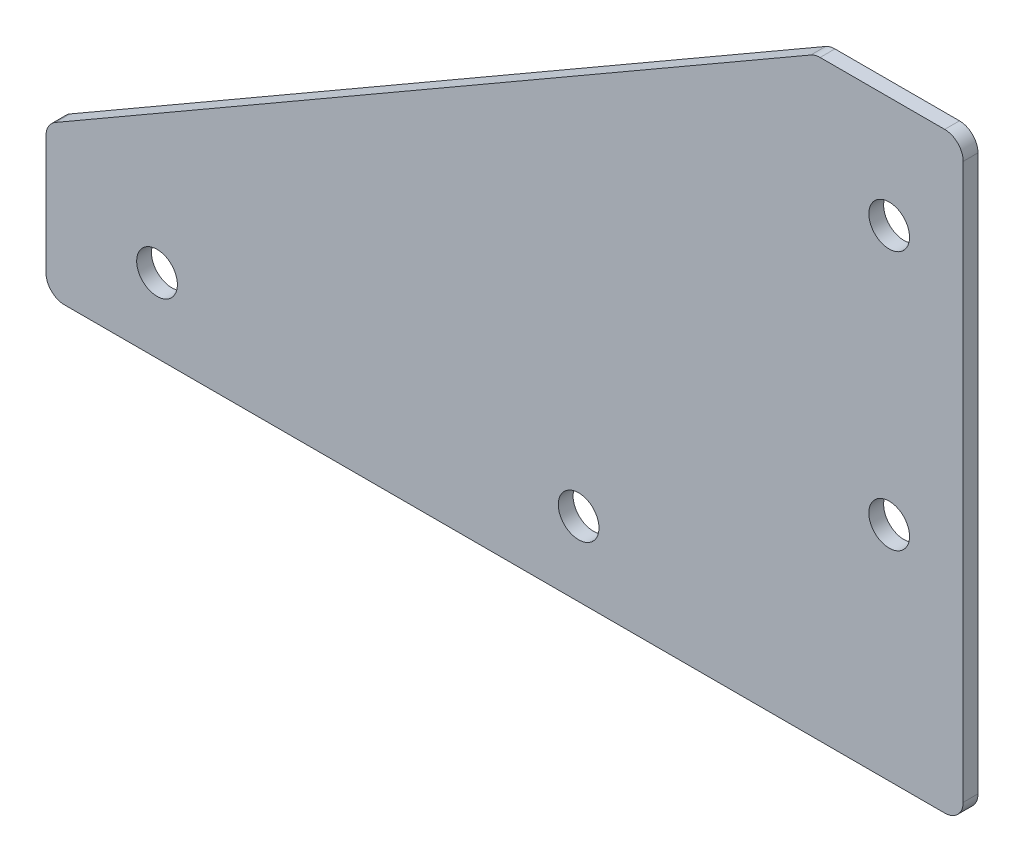
ISO-10303-21;
HEADER;
FILE_DESCRIPTION(('STEP AP214'),'2;1');
FILE_NAME('part.step','',(''),(''),'','','');
FILE_SCHEMA(('AUTOMOTIVE_DESIGN { 1 0 10303 214 1 1 1 1 }'));
ENDSEC;
DATA;
#1=APPLICATION_CONTEXT('core data for automotive mechanical design processes');
#2=APPLICATION_PROTOCOL_DEFINITION('international standard','automotive_design',2000,#1);
#3=PRODUCT_CONTEXT('',#1,'mechanical');
#4=PRODUCT('Part','Part','',(#3));
#5=PRODUCT_RELATED_PRODUCT_CATEGORY('part','',(#4));
#6=PRODUCT_DEFINITION_FORMATION('','',#4);
#7=PRODUCT_DEFINITION_CONTEXT('part definition',#1,'design');
#8=PRODUCT_DEFINITION('design','',#6,#7);
#9=PRODUCT_DEFINITION_SHAPE('','',#8);
#10=(LENGTH_UNIT() NAMED_UNIT(*) SI_UNIT(.MILLI.,.METRE.));
#11=(NAMED_UNIT(*) PLANE_ANGLE_UNIT() SI_UNIT($,.RADIAN.));
#12=(NAMED_UNIT(*) SI_UNIT($,.STERADIAN.) SOLID_ANGLE_UNIT());
#13=UNCERTAINTY_MEASURE_WITH_UNIT(LENGTH_MEASURE(1.E-05),#10,'distance_accuracy_value','');
#14=(GEOMETRIC_REPRESENTATION_CONTEXT(3) GLOBAL_UNCERTAINTY_ASSIGNED_CONTEXT((#13)) GLOBAL_UNIT_ASSIGNED_CONTEXT((#10,
#11,#12)) REPRESENTATION_CONTEXT('',''));
#15=CARTESIAN_POINT('',(0.,0.,0.));
#16=DIRECTION('',(0.,0.,1.));
#17=DIRECTION('',(1.,0.,0.));
#18=AXIS2_PLACEMENT_3D('',#15,#16,#17);
#19=CARTESIAN_POINT('',(0.,60.,-2.));
#20=DIRECTION('',(0.,1.,0.));
#21=DIRECTION('',(0.,0.,1.));
#22=AXIS2_PLACEMENT_3D('',#19,#20,#21);
#23=PLANE('',#22);
#24=DIRECTION('',(-1.,0.,0.));
#25=VECTOR('',#24,1.);
#26=CARTESIAN_POINT('',(0.,60.,0.));
#27=LINE('',#26,#25);
#28=CARTESIAN_POINT('',(17.5,60.,0.));
#29=VERTEX_POINT('',#28);
#30=CARTESIAN_POINT('',(0.669872981077787,60.,0.));
#31=VERTEX_POINT('',#30);
#32=EDGE_CURVE('E187',#29,#31,#27,.T.);
#33=ORIENTED_EDGE('',*,*,#32,.F.);
#34=DIRECTION('',(0.,0.,1.));
#35=VECTOR('',#34,1.);
#36=CARTESIAN_POINT('',(17.5,60.,-2.));
#37=LINE('',#36,#35);
#38=CARTESIAN_POINT('',(17.5,60.,-2.));
#39=VERTEX_POINT('',#38);
#40=EDGE_CURVE('E155',#29,#39,#37,.F.);
#41=ORIENTED_EDGE('',*,*,#40,.T.);
#42=DIRECTION('',(-1.,0.,0.));
#43=VECTOR('',#42,1.);
#44=CARTESIAN_POINT('',(0.,60.,-2.));
#45=LINE('',#44,#43);
#46=CARTESIAN_POINT('',(0.669872981077787,60.,-2.));
#47=VERTEX_POINT('',#46);
#48=EDGE_CURVE('E134',#39,#47,#45,.T.);
#49=ORIENTED_EDGE('',*,*,#48,.T.);
#50=DIRECTION('',(0.,0.,1.));
#51=VECTOR('',#50,1.);
#52=CARTESIAN_POINT('',(0.669872981077787,60.,-2.));
#53=LINE('',#52,#51);
#54=EDGE_CURVE('E152',#47,#31,#53,.T.);
#55=ORIENTED_EDGE('',*,*,#54,.T.);
#56=EDGE_LOOP('',(#33,#41,#49,#55));
#57=FACE_BOUND('',#56,.T.);
#58=ADVANCED_FACE('F35',(#57),#23,.T.);
#59=CARTESIAN_POINT('',(20.,60.,-2.));
#60=DIRECTION('',(1.,0.,0.));
#61=DIRECTION('',(0.,1.,0.));
#62=AXIS2_PLACEMENT_3D('',#59,#60,#61);
#63=PLANE('',#62);
#64=DIRECTION('',(0.,1.,0.));
#65=VECTOR('',#64,1.);
#66=CARTESIAN_POINT('',(20.,0.,-2.));
#67=LINE('',#66,#65);
#68=CARTESIAN_POINT('',(20.,-17.5,-2.));
#69=VERTEX_POINT('',#68);
#70=CARTESIAN_POINT('',(20.,57.5,-2.));
#71=VERTEX_POINT('',#70);
#72=EDGE_CURVE('E139',#69,#71,#67,.T.);
#73=ORIENTED_EDGE('',*,*,#72,.T.);
#74=DIRECTION('',(0.,0.,1.));
#75=VECTOR('',#74,1.);
#76=CARTESIAN_POINT('',(20.,57.5,-2.));
#77=LINE('',#76,#75);
#78=CARTESIAN_POINT('',(20.,57.5,0.));
#79=VERTEX_POINT('',#78);
#80=EDGE_CURVE('E133',#71,#79,#77,.T.);
#81=ORIENTED_EDGE('',*,*,#80,.T.);
#82=DIRECTION('',(0.,1.,0.));
#83=VECTOR('',#82,1.);
#84=CARTESIAN_POINT('',(20.,60.,0.));
#85=LINE('',#84,#83);
#86=CARTESIAN_POINT('',(20.,-17.5,0.));
#87=VERTEX_POINT('',#86);
#88=EDGE_CURVE('E116',#87,#79,#85,.T.);
#89=ORIENTED_EDGE('',*,*,#88,.F.);
#90=DIRECTION('',(0.,0.,1.));
#91=VECTOR('',#90,1.);
#92=CARTESIAN_POINT('',(20.,-17.5,-2.));
#93=LINE('',#92,#91);
#94=EDGE_CURVE('E130',#87,#69,#93,.F.);
#95=ORIENTED_EDGE('',*,*,#94,.T.);
#96=EDGE_LOOP('',(#73,#81,#89,#95));
#97=FACE_BOUND('',#96,.T.);
#98=ADVANCED_FACE('F129',(#97),#63,.T.);
#99=CARTESIAN_POINT('',(-103.923048454134,-20.,-2.));
#100=DIRECTION('',(0.,-1.,0.));
#101=DIRECTION('',(1.,0.,0.));
#102=AXIS2_PLACEMENT_3D('',#99,#100,#101);
#103=PLANE('',#102);
#104=DIRECTION('',(1.,0.,0.));
#105=VECTOR('',#104,1.);
#106=CARTESIAN_POINT('',(-103.923048454134,-20.,-2.));
#107=LINE('',#106,#105);
#108=CARTESIAN_POINT('',(-101.423048454134,-20.,-2.));
#109=VERTEX_POINT('',#108);
#110=CARTESIAN_POINT('',(17.5,-20.,-2.));
#111=VERTEX_POINT('',#110);
#112=EDGE_CURVE('E143',#109,#111,#107,.T.);
#113=ORIENTED_EDGE('',*,*,#112,.T.);
#114=DIRECTION('',(0.,0.,1.));
#115=VECTOR('',#114,1.);
#116=CARTESIAN_POINT('',(17.5,-20.,-2.));
#117=LINE('',#116,#115);
#118=CARTESIAN_POINT('',(17.5,-20.,0.));
#119=VERTEX_POINT('',#118);
#120=EDGE_CURVE('E167',#111,#119,#117,.T.);
#121=ORIENTED_EDGE('',*,*,#120,.T.);
#122=DIRECTION('',(1.,0.,0.));
#123=VECTOR('',#122,1.);
#124=CARTESIAN_POINT('',(-103.923048454134,-20.,0.));
#125=LINE('',#124,#123);
#126=CARTESIAN_POINT('',(-101.423048454134,-20.,0.));
#127=VERTEX_POINT('',#126);
#128=EDGE_CURVE('E118',#127,#119,#125,.T.);
#129=ORIENTED_EDGE('',*,*,#128,.F.);
#130=DIRECTION('',(0.,0.,1.));
#131=VECTOR('',#130,1.);
#132=CARTESIAN_POINT('',(-101.423048454134,-20.,-2.));
#133=LINE('',#132,#131);
#134=EDGE_CURVE('E165',#127,#109,#133,.F.);
#135=ORIENTED_EDGE('',*,*,#134,.T.);
#136=EDGE_LOOP('',(#113,#121,#129,#135));
#137=FACE_BOUND('',#136,.T.);
#138=ADVANCED_FACE('F255',(#137),#103,.T.);
#139=CARTESIAN_POINT('',(-103.923048454134,0.,-2.));
#140=DIRECTION('',(-1.,0.,0.));
#141=DIRECTION('',(0.,0.,1.));
#142=AXIS2_PLACEMENT_3D('',#139,#140,#141);
#143=PLANE('',#142);
#144=DIRECTION('',(0.,-1.,0.));
#145=VECTOR('',#144,1.);
#146=CARTESIAN_POINT('',(-103.923048454134,0.,-2.));
#147=LINE('',#146,#145);
#148=CARTESIAN_POINT('',(-103.923048454134,-1.44337567297408,-2.));
#149=VERTEX_POINT('',#148);
#150=CARTESIAN_POINT('',(-103.923048454134,-17.5,-2.));
#151=VERTEX_POINT('',#150);
#152=EDGE_CURVE('E181',#149,#151,#147,.T.);
#153=ORIENTED_EDGE('',*,*,#152,.T.);
#154=DIRECTION('',(0.,0.,1.));
#155=VECTOR('',#154,1.);
#156=CARTESIAN_POINT('',(-103.923048454134,-17.5,-2.));
#157=LINE('',#156,#155);
#158=CARTESIAN_POINT('',(-103.923048454134,-17.5,0.));
#159=VERTEX_POINT('',#158);
#160=EDGE_CURVE('E171',#151,#159,#157,.T.);
#161=ORIENTED_EDGE('',*,*,#160,.T.);
#162=DIRECTION('',(0.,-1.,0.));
#163=VECTOR('',#162,1.);
#164=CARTESIAN_POINT('',(-103.923048454134,0.,0.));
#165=LINE('',#164,#163);
#166=CARTESIAN_POINT('',(-103.923048454134,-1.44337567297408,0.));
#167=VERTEX_POINT('',#166);
#168=EDGE_CURVE('E179',#167,#159,#165,.T.);
#169=ORIENTED_EDGE('',*,*,#168,.F.);
#170=DIRECTION('',(0.,0.,1.));
#171=VECTOR('',#170,1.);
#172=CARTESIAN_POINT('',(-103.923048454134,-1.44337567297408,-2.));
#173=LINE('',#172,#171);
#174=EDGE_CURVE('E169',#167,#149,#173,.F.);
#175=ORIENTED_EDGE('',*,*,#174,.T.);
#176=EDGE_LOOP('',(#153,#161,#169,#175));
#177=FACE_BOUND('',#176,.T.);
#178=ADVANCED_FACE('F178',(#177),#143,.T.);
#179=CARTESIAN_POINT('',(0.,60.,-2.));
#180=DIRECTION('',(-0.499999999999995,0.866025403784442,0.));
#181=DIRECTION('',(-0.866025403784442,-0.499999999999995,0.));
#182=AXIS2_PLACEMENT_3D('',#179,#180,#181);
#183=PLANE('',#182);
#184=DIRECTION('',(-0.866025403784442,-0.499999999999995,0.));
#185=VECTOR('',#184,1.);
#186=CARTESIAN_POINT('',(0.,60.,-2.));
#187=LINE('',#186,#185);
#188=CARTESIAN_POINT('',(-0.580127018922202,59.6650635094611,-2.));
#189=VERTEX_POINT('',#188);
#190=CARTESIAN_POINT('',(-102.673048454134,0.721687836487024,-2.));
#191=VERTEX_POINT('',#190);
#192=EDGE_CURVE('E196',#189,#191,#187,.T.);
#193=ORIENTED_EDGE('',*,*,#192,.T.);
#194=DIRECTION('',(0.,0.,1.));
#195=VECTOR('',#194,1.);
#196=CARTESIAN_POINT('',(-102.673048454134,0.721687836487024,-2.));
#197=LINE('',#196,#195);
#198=CARTESIAN_POINT('',(-102.673048454134,0.721687836487024,0.));
#199=VERTEX_POINT('',#198);
#200=EDGE_CURVE('E11',#191,#199,#197,.T.);
#201=ORIENTED_EDGE('',*,*,#200,.T.);
#202=DIRECTION('',(-0.866025403784442,-0.499999999999995,0.));
#203=VECTOR('',#202,1.);
#204=CARTESIAN_POINT('',(0.,60.,0.));
#205=LINE('',#204,#203);
#206=CARTESIAN_POINT('',(-0.580127018922202,59.6650635094611,0.));
#207=VERTEX_POINT('',#206);
#208=EDGE_CURVE('E185',#207,#199,#205,.T.);
#209=ORIENTED_EDGE('',*,*,#208,.F.);
#210=DIRECTION('',(0.,0.,1.));
#211=VECTOR('',#210,1.);
#212=CARTESIAN_POINT('',(-0.580127018922202,59.6650635094611,-2.));
#213=LINE('',#212,#211);
#214=EDGE_CURVE('E43',#207,#189,#213,.F.);
#215=ORIENTED_EDGE('',*,*,#214,.T.);
#216=EDGE_LOOP('',(#193,#201,#209,#215));
#217=FACE_BOUND('',#216,.T.);
#218=ADVANCED_FACE('F260',(#217),#183,.T.);
#219=CARTESIAN_POINT('',(0.,0.,-2.));
#220=DIRECTION('',(0.,0.,-1.));
#221=DIRECTION('',(-1.,0.,0.));
#222=AXIS2_PLACEMENT_3D('',#219,#220,#221);
#223=PLANE('',#222);
#224=CARTESIAN_POINT('',(-88.923048454134,-10.,-2.));
#225=DIRECTION('',(0.,0.,1.));
#226=DIRECTION('',(1.,0.,0.));
#227=AXIS2_PLACEMENT_3D('',#224,#225,#226);
#228=CIRCLE('',#227,2.75);
#229=CARTESIAN_POINT('',(-86.173048454134,-10.,-2.));
#230=VERTEX_POINT('',#229);
#231=EDGE_CURVE('E217',#230,#230,#228,.T.);
#232=ORIENTED_EDGE('',*,*,#231,.T.);
#233=EDGE_LOOP('',(#232));
#234=FACE_BOUND('',#233,.T.);
#235=CARTESIAN_POINT('',(-31.96,-10.,-2.));
#236=DIRECTION('',(0.,0.,1.));
#237=DIRECTION('',(1.,0.,0.));
#238=AXIS2_PLACEMENT_3D('',#235,#236,#237);
#239=CIRCLE('',#238,2.75);
#240=CARTESIAN_POINT('',(-29.21,-10.,-2.));
#241=VERTEX_POINT('',#240);
#242=EDGE_CURVE('E211',#241,#241,#239,.T.);
#243=ORIENTED_EDGE('',*,*,#242,.T.);
#244=EDGE_LOOP('',(#243));
#245=FACE_BOUND('',#244,.T.);
#246=CARTESIAN_POINT('',(9.99999999999999,9.99999999999999,-2.));
#247=DIRECTION('',(0.,0.,1.));
#248=DIRECTION('',(1.,0.,0.));
#249=AXIS2_PLACEMENT_3D('',#246,#247,#248);
#250=CIRCLE('',#249,2.75);
#251=CARTESIAN_POINT('',(12.75,9.99999999999999,-2.));
#252=VERTEX_POINT('',#251);
#253=EDGE_CURVE('E205',#252,#252,#250,.T.);
#254=ORIENTED_EDGE('',*,*,#253,.T.);
#255=EDGE_LOOP('',(#254));
#256=FACE_BOUND('',#255,.T.);
#257=CARTESIAN_POINT('',(9.99999999999998,45.,-2.));
#258=DIRECTION('',(0.,0.,1.));
#259=DIRECTION('',(1.,0.,0.));
#260=AXIS2_PLACEMENT_3D('',#257,#258,#259);
#261=CIRCLE('',#260,2.75);
#262=CARTESIAN_POINT('',(12.75,45.,-2.));
#263=VERTEX_POINT('',#262);
#264=EDGE_CURVE('E191',#263,#263,#261,.T.);
#265=ORIENTED_EDGE('',*,*,#264,.T.);
#266=EDGE_LOOP('',(#265));
#267=FACE_BOUND('',#266,.T.);
#268=ORIENTED_EDGE('',*,*,#48,.F.);
#269=CARTESIAN_POINT('',(17.5,57.5,-2.));
#270=DIRECTION('',(0.,0.,-1.));
#271=DIRECTION('',(-1.,0.,0.));
#272=AXIS2_PLACEMENT_3D('',#269,#270,#271);
#273=CIRCLE('',#272,2.5);
#274=EDGE_CURVE('E163',#39,#71,#273,.T.);
#275=ORIENTED_EDGE('',*,*,#274,.T.);
#276=ORIENTED_EDGE('',*,*,#72,.F.);
#277=CARTESIAN_POINT('',(17.5,-17.5,-2.));
#278=DIRECTION('',(0.,0.,-1.));
#279=DIRECTION('',(-1.,0.,0.));
#280=AXIS2_PLACEMENT_3D('',#277,#278,#279);
#281=CIRCLE('',#280,2.5);
#282=EDGE_CURVE('E138',#69,#111,#281,.T.);
#283=ORIENTED_EDGE('',*,*,#282,.T.);
#284=ORIENTED_EDGE('',*,*,#112,.F.);
#285=CARTESIAN_POINT('',(-101.423048454134,-17.5,-2.));
#286=DIRECTION('',(0.,0.,-1.));
#287=DIRECTION('',(-1.,0.,0.));
#288=AXIS2_PLACEMENT_3D('',#285,#286,#287);
#289=CIRCLE('',#288,2.5);
#290=EDGE_CURVE('E160',#109,#151,#289,.T.);
#291=ORIENTED_EDGE('',*,*,#290,.T.);
#292=ORIENTED_EDGE('',*,*,#152,.F.);
#293=CARTESIAN_POINT('',(-101.423048454134,-1.44337567297408,-2.));
#294=DIRECTION('',(0.,0.,-1.));
#295=DIRECTION('',(-1.,0.,0.));
#296=AXIS2_PLACEMENT_3D('',#293,#294,#295);
#297=CIRCLE('',#296,2.5);
#298=EDGE_CURVE('E50',#149,#191,#297,.T.);
#299=ORIENTED_EDGE('',*,*,#298,.T.);
#300=ORIENTED_EDGE('',*,*,#192,.F.);
#301=CARTESIAN_POINT('',(0.669872981077787,57.5,-2.));
#302=DIRECTION('',(0.,0.,-1.));
#303=DIRECTION('',(-1.,0.,0.));
#304=AXIS2_PLACEMENT_3D('',#301,#302,#303);
#305=CIRCLE('',#304,2.5);
#306=EDGE_CURVE('E157',#189,#47,#305,.T.);
#307=ORIENTED_EDGE('',*,*,#306,.T.);
#308=EDGE_LOOP('',(#268,#275,#276,#283,#284,#291,#292,#299,#300,#307));
#309=FACE_BOUND('',#308,.T.);
#310=ADVANCED_FACE('F229',(#234,#245,#256,#267,#309),#223,.T.);
#311=CARTESIAN_POINT('',(0.,0.,0.));
#312=DIRECTION('',(0.,0.,-1.));
#313=DIRECTION('',(-1.,0.,0.));
#314=AXIS2_PLACEMENT_3D('',#311,#312,#313);
#315=PLANE('',#314);
#316=CARTESIAN_POINT('',(-88.923048454134,-10.,0.));
#317=DIRECTION('',(0.,0.,1.));
#318=DIRECTION('',(1.,0.,0.));
#319=AXIS2_PLACEMENT_3D('',#316,#317,#318);
#320=CIRCLE('',#319,2.74999999999999);
#321=CARTESIAN_POINT('',(-86.173048454134,-10.,0.));
#322=VERTEX_POINT('',#321);
#323=EDGE_CURVE('E220',#322,#322,#320,.T.);
#324=ORIENTED_EDGE('',*,*,#323,.F.);
#325=EDGE_LOOP('',(#324));
#326=FACE_BOUND('',#325,.T.);
#327=CARTESIAN_POINT('',(-31.96,-10.,0.));
#328=DIRECTION('',(0.,0.,1.));
#329=DIRECTION('',(1.,0.,0.));
#330=AXIS2_PLACEMENT_3D('',#327,#328,#329);
#331=CIRCLE('',#330,2.74999999999999);
#332=CARTESIAN_POINT('',(-29.21,-10.,0.));
#333=VERTEX_POINT('',#332);
#334=EDGE_CURVE('E214',#333,#333,#331,.T.);
#335=ORIENTED_EDGE('',*,*,#334,.F.);
#336=EDGE_LOOP('',(#335));
#337=FACE_BOUND('',#336,.T.);
#338=CARTESIAN_POINT('',(9.99999999999999,9.99999999999999,0.));
#339=DIRECTION('',(0.,0.,1.));
#340=DIRECTION('',(1.,0.,0.));
#341=AXIS2_PLACEMENT_3D('',#338,#339,#340);
#342=CIRCLE('',#341,2.74999999999999);
#343=CARTESIAN_POINT('',(12.75,9.99999999999999,0.));
#344=VERTEX_POINT('',#343);
#345=EDGE_CURVE('E208',#344,#344,#342,.T.);
#346=ORIENTED_EDGE('',*,*,#345,.F.);
#347=EDGE_LOOP('',(#346));
#348=FACE_BOUND('',#347,.T.);
#349=CARTESIAN_POINT('',(9.99999999999998,45.,0.));
#350=DIRECTION('',(0.,0.,1.));
#351=DIRECTION('',(1.,0.,0.));
#352=AXIS2_PLACEMENT_3D('',#349,#350,#351);
#353=CIRCLE('',#352,2.74999999999999);
#354=CARTESIAN_POINT('',(12.75,45.,0.));
#355=VERTEX_POINT('',#354);
#356=EDGE_CURVE('E202',#355,#355,#353,.T.);
#357=ORIENTED_EDGE('',*,*,#356,.F.);
#358=EDGE_LOOP('',(#357));
#359=FACE_BOUND('',#358,.T.);
#360=ORIENTED_EDGE('',*,*,#88,.T.);
#361=CARTESIAN_POINT('',(17.5,57.5,0.));
#362=DIRECTION('',(0.,0.,-1.));
#363=DIRECTION('',(-1.,0.,0.));
#364=AXIS2_PLACEMENT_3D('',#361,#362,#363);
#365=CIRCLE('',#364,2.5);
#366=EDGE_CURVE('E123',#79,#29,#365,.F.);
#367=ORIENTED_EDGE('',*,*,#366,.T.);
#368=ORIENTED_EDGE('',*,*,#32,.T.);
#369=CARTESIAN_POINT('',(0.669872981077787,57.5,0.));
#370=DIRECTION('',(0.,0.,-1.));
#371=DIRECTION('',(-1.,0.,0.));
#372=AXIS2_PLACEMENT_3D('',#369,#370,#371);
#373=CIRCLE('',#372,2.5);
#374=EDGE_CURVE('E141',#31,#207,#373,.F.);
#375=ORIENTED_EDGE('',*,*,#374,.T.);
#376=ORIENTED_EDGE('',*,*,#208,.T.);
#377=CARTESIAN_POINT('',(-101.423048454134,-1.44337567297408,0.));
#378=DIRECTION('',(0.,0.,-1.));
#379=DIRECTION('',(-1.,0.,0.));
#380=AXIS2_PLACEMENT_3D('',#377,#378,#379);
#381=CIRCLE('',#380,2.5);
#382=EDGE_CURVE('E148',#199,#167,#381,.F.);
#383=ORIENTED_EDGE('',*,*,#382,.T.);
#384=ORIENTED_EDGE('',*,*,#168,.T.);
#385=CARTESIAN_POINT('',(-101.423048454134,-17.5,0.));
#386=DIRECTION('',(0.,0.,-1.));
#387=DIRECTION('',(-1.,0.,0.));
#388=AXIS2_PLACEMENT_3D('',#385,#386,#387);
#389=CIRCLE('',#388,2.5);
#390=EDGE_CURVE('E124',#159,#127,#389,.F.);
#391=ORIENTED_EDGE('',*,*,#390,.T.);
#392=ORIENTED_EDGE('',*,*,#128,.T.);
#393=CARTESIAN_POINT('',(17.5,-17.5,0.));
#394=DIRECTION('',(0.,0.,-1.));
#395=DIRECTION('',(-1.,0.,0.));
#396=AXIS2_PLACEMENT_3D('',#393,#394,#395);
#397=CIRCLE('',#396,2.5);
#398=EDGE_CURVE('E113',#119,#87,#397,.F.);
#399=ORIENTED_EDGE('',*,*,#398,.T.);
#400=EDGE_LOOP('',(#360,#367,#368,#375,#376,#383,#384,#391,#392,#399));
#401=FACE_BOUND('',#400,.T.);
#402=ADVANCED_FACE('F115',(#326,#337,#348,#359,#401),#315,.F.);
#403=CARTESIAN_POINT('',(9.99999999999998,45.,0.));
#404=DIRECTION('',(0.,0.,1.));
#405=DIRECTION('',(1.,0.,0.));
#406=AXIS2_PLACEMENT_3D('',#403,#404,#405);
#407=CYLINDRICAL_SURFACE('',#406,2.74999999999999);
#408=ORIENTED_EDGE('',*,*,#264,.F.);
#409=EDGE_LOOP('',(#408));
#410=FACE_BOUND('',#409,.T.);
#411=ORIENTED_EDGE('',*,*,#356,.T.);
#412=EDGE_LOOP('',(#411));
#413=FACE_BOUND('',#412,.T.);
#414=ADVANCED_FACE('F228',(#410,#413),#407,.F.);
#415=CARTESIAN_POINT('',(9.99999999999999,9.99999999999999,0.));
#416=DIRECTION('',(0.,0.,1.));
#417=DIRECTION('',(1.,0.,0.));
#418=AXIS2_PLACEMENT_3D('',#415,#416,#417);
#419=CYLINDRICAL_SURFACE('',#418,2.74999999999999);
#420=ORIENTED_EDGE('',*,*,#253,.F.);
#421=EDGE_LOOP('',(#420));
#422=FACE_BOUND('',#421,.T.);
#423=ORIENTED_EDGE('',*,*,#345,.T.);
#424=EDGE_LOOP('',(#423));
#425=FACE_BOUND('',#424,.T.);
#426=ADVANCED_FACE('F238',(#422,#425),#419,.F.);
#427=CARTESIAN_POINT('',(-31.96,-10.,0.));
#428=DIRECTION('',(0.,0.,1.));
#429=DIRECTION('',(1.,0.,0.));
#430=AXIS2_PLACEMENT_3D('',#427,#428,#429);
#431=CYLINDRICAL_SURFACE('',#430,2.74999999999999);
#432=ORIENTED_EDGE('',*,*,#242,.F.);
#433=EDGE_LOOP('',(#432));
#434=FACE_BOUND('',#433,.T.);
#435=ORIENTED_EDGE('',*,*,#334,.T.);
#436=EDGE_LOOP('',(#435));
#437=FACE_BOUND('',#436,.T.);
#438=ADVANCED_FACE('F244',(#434,#437),#431,.F.);
#439=CARTESIAN_POINT('',(-88.923048454134,-10.,0.));
#440=DIRECTION('',(0.,0.,1.));
#441=DIRECTION('',(1.,0.,0.));
#442=AXIS2_PLACEMENT_3D('',#439,#440,#441);
#443=CYLINDRICAL_SURFACE('',#442,2.75);
#444=ORIENTED_EDGE('',*,*,#231,.F.);
#445=EDGE_LOOP('',(#444));
#446=FACE_BOUND('',#445,.T.);
#447=ORIENTED_EDGE('',*,*,#323,.T.);
#448=EDGE_LOOP('',(#447));
#449=FACE_BOUND('',#448,.T.);
#450=ADVANCED_FACE('F224',(#446,#449),#443,.F.);
#451=CARTESIAN_POINT('',(17.5,57.5,-2.));
#452=DIRECTION('',(0.,0.,1.));
#453=DIRECTION('',(1.,0.,0.));
#454=AXIS2_PLACEMENT_3D('',#451,#452,#453);
#455=CYLINDRICAL_SURFACE('',#454,2.5);
#456=ORIENTED_EDGE('',*,*,#274,.F.);
#457=ORIENTED_EDGE('',*,*,#40,.F.);
#458=ORIENTED_EDGE('',*,*,#366,.F.);
#459=ORIENTED_EDGE('',*,*,#80,.F.);
#460=EDGE_LOOP('',(#456,#457,#458,#459));
#461=FACE_BOUND('',#460,.T.);
#462=ADVANCED_FACE('F262',(#461),#455,.T.);
#463=CARTESIAN_POINT('',(17.5,-17.5,-2.));
#464=DIRECTION('',(0.,0.,1.));
#465=DIRECTION('',(1.,0.,0.));
#466=AXIS2_PLACEMENT_3D('',#463,#464,#465);
#467=CYLINDRICAL_SURFACE('',#466,2.5);
#468=ORIENTED_EDGE('',*,*,#282,.F.);
#469=ORIENTED_EDGE('',*,*,#94,.F.);
#470=ORIENTED_EDGE('',*,*,#398,.F.);
#471=ORIENTED_EDGE('',*,*,#120,.F.);
#472=EDGE_LOOP('',(#468,#469,#470,#471));
#473=FACE_BOUND('',#472,.T.);
#474=ADVANCED_FACE('F137',(#473),#467,.T.);
#475=CARTESIAN_POINT('',(-101.423048454134,-17.5,-2.));
#476=DIRECTION('',(0.,0.,1.));
#477=DIRECTION('',(1.,0.,0.));
#478=AXIS2_PLACEMENT_3D('',#475,#476,#477);
#479=CYLINDRICAL_SURFACE('',#478,2.5);
#480=ORIENTED_EDGE('',*,*,#290,.F.);
#481=ORIENTED_EDGE('',*,*,#134,.F.);
#482=ORIENTED_EDGE('',*,*,#390,.F.);
#483=ORIENTED_EDGE('',*,*,#160,.F.);
#484=EDGE_LOOP('',(#480,#481,#482,#483));
#485=FACE_BOUND('',#484,.T.);
#486=ADVANCED_FACE('F268',(#485),#479,.T.);
#487=CARTESIAN_POINT('',(-101.423048454134,-1.44337567297408,-2.));
#488=DIRECTION('',(0.,0.,1.));
#489=DIRECTION('',(1.,0.,0.));
#490=AXIS2_PLACEMENT_3D('',#487,#488,#489);
#491=CYLINDRICAL_SURFACE('',#490,2.5);
#492=ORIENTED_EDGE('',*,*,#298,.F.);
#493=ORIENTED_EDGE('',*,*,#174,.F.);
#494=ORIENTED_EDGE('',*,*,#382,.F.);
#495=ORIENTED_EDGE('',*,*,#200,.F.);
#496=EDGE_LOOP('',(#492,#493,#494,#495));
#497=FACE_BOUND('',#496,.T.);
#498=ADVANCED_FACE('F270',(#497),#491,.T.);
#499=CARTESIAN_POINT('',(0.669872981077787,57.5,-2.));
#500=DIRECTION('',(0.,0.,1.));
#501=DIRECTION('',(1.,0.,0.));
#502=AXIS2_PLACEMENT_3D('',#499,#500,#501);
#503=CYLINDRICAL_SURFACE('',#502,2.5);
#504=ORIENTED_EDGE('',*,*,#306,.F.);
#505=ORIENTED_EDGE('',*,*,#214,.F.);
#506=ORIENTED_EDGE('',*,*,#374,.F.);
#507=ORIENTED_EDGE('',*,*,#54,.F.);
#508=EDGE_LOOP('',(#504,#505,#506,#507));
#509=FACE_BOUND('',#508,.T.);
#510=ADVANCED_FACE('F37',(#509),#503,.T.);
#511=CLOSED_SHELL('',(#58,#98,#138,#178,#218,#310,#402,#414,#426,#438,#450,#462,#474,#486,#498,#510));
#512=MANIFOLD_SOLID_BREP('B2',#511);
#513=ADVANCED_BREP_SHAPE_REPRESENTATION('',(#18,#512),#14);
#514=SHAPE_DEFINITION_REPRESENTATION(#9,#513);
ENDSEC;
END-ISO-10303-21;
